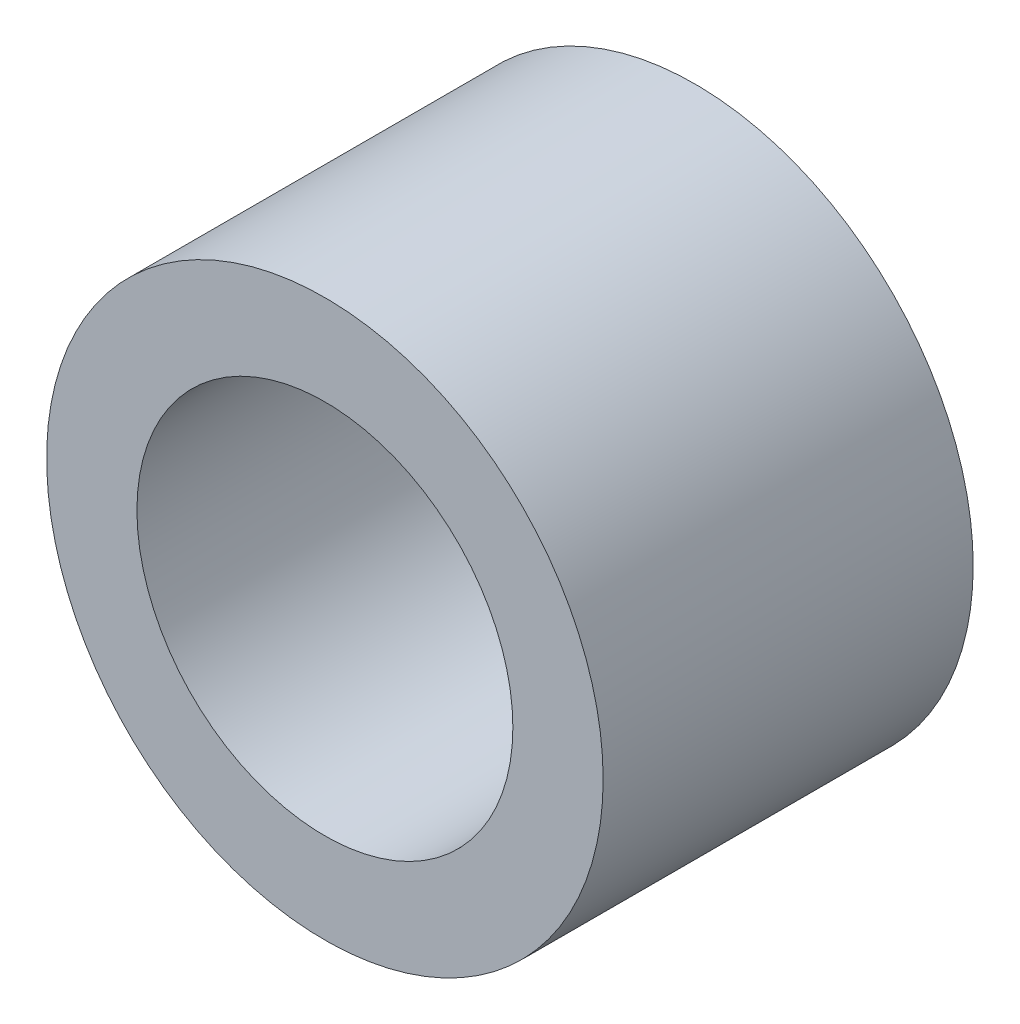
ISO-10303-21;
HEADER;
FILE_DESCRIPTION(('STEP AP214'),'2;1');
FILE_NAME('part.step','',(''),(''),'','','');
FILE_SCHEMA(('AUTOMOTIVE_DESIGN { 1 0 10303 214 1 1 1 1 }'));
ENDSEC;
DATA;
#1=APPLICATION_CONTEXT('core data for automotive mechanical design processes');
#2=APPLICATION_PROTOCOL_DEFINITION('international standard','automotive_design',2000,#1);
#3=PRODUCT_CONTEXT('',#1,'mechanical');
#4=PRODUCT('Part','Part','',(#3));
#5=PRODUCT_RELATED_PRODUCT_CATEGORY('part','',(#4));
#6=PRODUCT_DEFINITION_FORMATION('','',#4);
#7=PRODUCT_DEFINITION_CONTEXT('part definition',#1,'design');
#8=PRODUCT_DEFINITION('design','',#6,#7);
#9=PRODUCT_DEFINITION_SHAPE('','',#8);
#10=(LENGTH_UNIT() NAMED_UNIT(*) SI_UNIT(.MILLI.,.METRE.));
#11=(NAMED_UNIT(*) PLANE_ANGLE_UNIT() SI_UNIT($,.RADIAN.));
#12=(NAMED_UNIT(*) SI_UNIT($,.STERADIAN.) SOLID_ANGLE_UNIT());
#13=UNCERTAINTY_MEASURE_WITH_UNIT(LENGTH_MEASURE(1.E-05),#10,'distance_accuracy_value','');
#14=(GEOMETRIC_REPRESENTATION_CONTEXT(3) GLOBAL_UNCERTAINTY_ASSIGNED_CONTEXT((#13)) GLOBAL_UNIT_ASSIGNED_CONTEXT((#10,
#11,#12)) REPRESENTATION_CONTEXT('',''));
#15=CARTESIAN_POINT('',(0.,0.,0.));
#16=DIRECTION('',(0.,0.,1.));
#17=DIRECTION('',(1.,0.,0.));
#18=AXIS2_PLACEMENT_3D('',#15,#16,#17);
#19=CARTESIAN_POINT('',(0.,0.,3.175));
#20=DIRECTION('',(0.,0.,1.));
#21=DIRECTION('',(1.,0.,0.));
#22=AXIS2_PLACEMENT_3D('',#19,#20,#21);
#23=PLANE('',#22);
#24=CARTESIAN_POINT('',(0.,0.,3.175));
#25=DIRECTION('',(0.,0.,1.));
#26=DIRECTION('',(1.,0.,0.));
#27=AXIS2_PLACEMENT_3D('',#24,#25,#26);
#28=CIRCLE('',#27,4.7752);
#29=CARTESIAN_POINT('',(4.7752,0.,3.175));
#30=VERTEX_POINT('',#29);
#31=EDGE_CURVE('E10',#30,#30,#28,.T.);
#32=ORIENTED_EDGE('',*,*,#31,.T.);
#33=EDGE_LOOP('',(#32));
#34=FACE_BOUND('',#33,.T.);
#35=CARTESIAN_POINT('',(0.,0.,3.175));
#36=DIRECTION('',(0.,0.,1.));
#37=DIRECTION('',(1.,0.,0.));
#38=AXIS2_PLACEMENT_3D('',#35,#36,#37);
#39=CIRCLE('',#38,3.2258);
#40=CARTESIAN_POINT('',(3.2258,0.,3.175));
#41=VERTEX_POINT('',#40);
#42=EDGE_CURVE('E43',#41,#41,#39,.T.);
#43=ORIENTED_EDGE('',*,*,#42,.F.);
#44=EDGE_LOOP('',(#43));
#45=FACE_BOUND('',#44,.T.);
#46=ADVANCED_FACE('F32',(#34,#45),#23,.T.);
#47=CARTESIAN_POINT('',(0.,0.,-3.175));
#48=DIRECTION('',(0.,0.,1.));
#49=DIRECTION('',(1.,0.,0.));
#50=AXIS2_PLACEMENT_3D('',#47,#48,#49);
#51=PLANE('',#50);
#52=CARTESIAN_POINT('',(0.,0.,-3.175));
#53=DIRECTION('',(0.,0.,1.));
#54=DIRECTION('',(1.,0.,0.));
#55=AXIS2_PLACEMENT_3D('',#52,#53,#54);
#56=CIRCLE('',#55,4.7752);
#57=CARTESIAN_POINT('',(4.7752,0.,-3.175));
#58=VERTEX_POINT('',#57);
#59=EDGE_CURVE('E36',#58,#58,#56,.T.);
#60=ORIENTED_EDGE('',*,*,#59,.F.);
#61=EDGE_LOOP('',(#60));
#62=FACE_BOUND('',#61,.T.);
#63=CARTESIAN_POINT('',(0.,0.,-3.175));
#64=DIRECTION('',(0.,0.,1.));
#65=DIRECTION('',(1.,0.,0.));
#66=AXIS2_PLACEMENT_3D('',#63,#64,#65);
#67=CIRCLE('',#66,3.2258);
#68=CARTESIAN_POINT('',(3.2258,0.,-3.175));
#69=VERTEX_POINT('',#68);
#70=EDGE_CURVE('E45',#69,#69,#67,.T.);
#71=ORIENTED_EDGE('',*,*,#70,.T.);
#72=EDGE_LOOP('',(#71));
#73=FACE_BOUND('',#72,.T.);
#74=ADVANCED_FACE('F55',(#62,#73),#51,.F.);
#75=CARTESIAN_POINT('',(0.,0.,3.175));
#76=DIRECTION('',(0.,0.,-1.));
#77=DIRECTION('',(-1.,0.,0.));
#78=AXIS2_PLACEMENT_3D('',#75,#76,#77);
#79=CYLINDRICAL_SURFACE('',#78,4.7752);
#80=ORIENTED_EDGE('',*,*,#31,.F.);
#81=EDGE_LOOP('',(#80));
#82=FACE_BOUND('',#81,.T.);
#83=ORIENTED_EDGE('',*,*,#59,.T.);
#84=EDGE_LOOP('',(#83));
#85=FACE_BOUND('',#84,.T.);
#86=ADVANCED_FACE('F34',(#82,#85),#79,.T.);
#87=CARTESIAN_POINT('',(0.,0.,3.175));
#88=DIRECTION('',(0.,0.,-1.));
#89=DIRECTION('',(-1.,0.,0.));
#90=AXIS2_PLACEMENT_3D('',#87,#88,#89);
#91=CYLINDRICAL_SURFACE('',#90,3.2258);
#92=ORIENTED_EDGE('',*,*,#42,.T.);
#93=EDGE_LOOP('',(#92));
#94=FACE_BOUND('',#93,.T.);
#95=ORIENTED_EDGE('',*,*,#70,.F.);
#96=EDGE_LOOP('',(#95));
#97=FACE_BOUND('',#96,.T.);
#98=ADVANCED_FACE('F51',(#94,#97),#91,.F.);
#99=CLOSED_SHELL('',(#46,#74,#86,#98));
#100=MANIFOLD_SOLID_BREP('B2',#99);
#101=ADVANCED_BREP_SHAPE_REPRESENTATION('',(#18,#100),#14);
#102=SHAPE_DEFINITION_REPRESENTATION(#9,#101);
ENDSEC;
END-ISO-10303-21;
